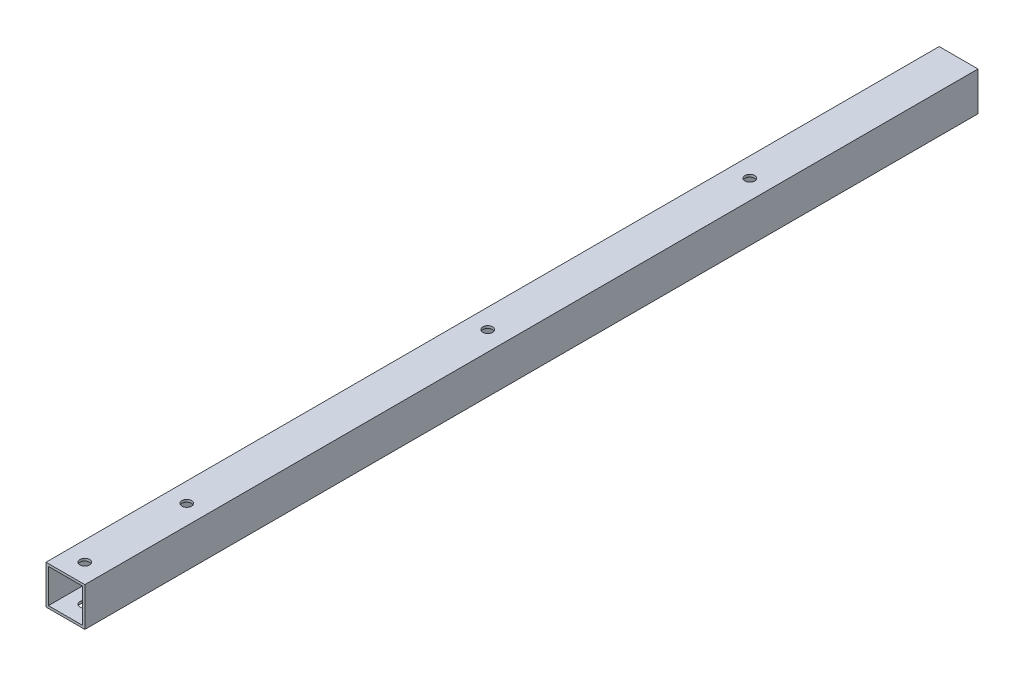
ISO-10303-21;
HEADER;
FILE_DESCRIPTION(('STEP AP214'),'2;1');
FILE_NAME('part.step','',(''),(''),'','','');
FILE_SCHEMA(('AUTOMOTIVE_DESIGN { 1 0 10303 214 1 1 1 1 }'));
ENDSEC;
DATA;
#1=APPLICATION_CONTEXT('core data for automotive mechanical design processes');
#2=APPLICATION_PROTOCOL_DEFINITION('international standard','automotive_design',2000,#1);
#3=PRODUCT_CONTEXT('',#1,'mechanical');
#4=PRODUCT('Part','Part','',(#3));
#5=PRODUCT_RELATED_PRODUCT_CATEGORY('part','',(#4));
#6=PRODUCT_DEFINITION_FORMATION('','',#4);
#7=PRODUCT_DEFINITION_CONTEXT('part definition',#1,'design');
#8=PRODUCT_DEFINITION('design','',#6,#7);
#9=PRODUCT_DEFINITION_SHAPE('','',#8);
#10=(LENGTH_UNIT() NAMED_UNIT(*) SI_UNIT(.MILLI.,.METRE.));
#11=(NAMED_UNIT(*) PLANE_ANGLE_UNIT() SI_UNIT($,.RADIAN.));
#12=(NAMED_UNIT(*) SI_UNIT($,.STERADIAN.) SOLID_ANGLE_UNIT());
#13=UNCERTAINTY_MEASURE_WITH_UNIT(LENGTH_MEASURE(1.E-05),#10,'distance_accuracy_value','');
#14=(GEOMETRIC_REPRESENTATION_CONTEXT(3) GLOBAL_UNCERTAINTY_ASSIGNED_CONTEXT((#13)) GLOBAL_UNIT_ASSIGNED_CONTEXT((#10,
#11,#12)) REPRESENTATION_CONTEXT('',''));
#15=CARTESIAN_POINT('',(0.,0.,0.));
#16=DIRECTION('',(0.,0.,1.));
#17=DIRECTION('',(1.,0.,0.));
#18=AXIS2_PLACEMENT_3D('',#15,#16,#17);
#19=CARTESIAN_POINT('',(-539.75,330.2,-50.8));
#20=DIRECTION('',(-1.,0.,0.));
#21=DIRECTION('',(0.,0.,1.));
#22=AXIS2_PLACEMENT_3D('',#19,#20,#21);
#23=PLANE('',#22);
#24=DIRECTION('',(0.,0.,1.));
#25=VECTOR('',#24,1.);
#26=CARTESIAN_POINT('',(-539.75,279.4,-50.8));
#27=LINE('',#26,#25);
#28=CARTESIAN_POINT('',(-539.75,279.4,-50.8));
#29=VERTEX_POINT('',#28);
#30=CARTESIAN_POINT('',(-539.75,279.4,1117.6));
#31=VERTEX_POINT('',#30);
#32=EDGE_CURVE('E171',#29,#31,#27,.T.);
#33=ORIENTED_EDGE('',*,*,#32,.T.);
#34=DIRECTION('',(0.,-1.,0.));
#35=VECTOR('',#34,1.);
#36=CARTESIAN_POINT('',(-539.75,330.2,1117.6));
#37=LINE('',#36,#35);
#38=CARTESIAN_POINT('',(-539.75,330.2,1117.6));
#39=VERTEX_POINT('',#38);
#40=EDGE_CURVE('E136',#39,#31,#37,.T.);
#41=ORIENTED_EDGE('',*,*,#40,.F.);
#42=DIRECTION('',(0.,0.,1.));
#43=VECTOR('',#42,1.);
#44=CARTESIAN_POINT('',(-539.75,330.2,-50.8));
#45=LINE('',#44,#43);
#46=CARTESIAN_POINT('',(-539.75,330.2,-50.8));
#47=VERTEX_POINT('',#46);
#48=EDGE_CURVE('E11',#47,#39,#45,.T.);
#49=ORIENTED_EDGE('',*,*,#48,.F.);
#50=DIRECTION('',(0.,-1.,0.));
#51=VECTOR('',#50,1.);
#52=CARTESIAN_POINT('',(-539.75,330.2,-50.8));
#53=LINE('',#52,#51);
#54=EDGE_CURVE('E156',#47,#29,#53,.T.);
#55=ORIENTED_EDGE('',*,*,#54,.T.);
#56=EDGE_LOOP('',(#33,#41,#49,#55));
#57=FACE_BOUND('',#56,.T.);
#58=ADVANCED_FACE('F37',(#57),#23,.T.);
#59=CARTESIAN_POINT('',(-539.75,330.2,-50.8));
#60=DIRECTION('',(0.,1.,0.));
#61=DIRECTION('',(0.,0.,1.));
#62=AXIS2_PLACEMENT_3D('',#59,#60,#61);
#63=PLANE('',#62);
#64=CARTESIAN_POINT('',(-514.35,330.2,222.25));
#65=DIRECTION('',(0.,1.,0.));
#66=DIRECTION('',(0.,0.,1.));
#67=AXIS2_PLACEMENT_3D('',#64,#65,#66);
#68=CIRCLE('',#67,6.34999999999994);
#69=CARTESIAN_POINT('',(-514.35,330.2,228.6));
#70=VERTEX_POINT('',#69);
#71=EDGE_CURVE('E364',#70,#70,#68,.T.);
#72=ORIENTED_EDGE('',*,*,#71,.F.);
#73=EDGE_LOOP('',(#72));
#74=FACE_BOUND('',#73,.T.);
#75=CARTESIAN_POINT('',(-514.35,330.2,565.15));
#76=DIRECTION('',(0.,1.,0.));
#77=DIRECTION('',(0.,0.,1.));
#78=AXIS2_PLACEMENT_3D('',#75,#76,#77);
#79=CIRCLE('',#78,6.34999999999994);
#80=CARTESIAN_POINT('',(-514.35,330.2,571.5));
#81=VERTEX_POINT('',#80);
#82=EDGE_CURVE('E201',#81,#81,#79,.T.);
#83=ORIENTED_EDGE('',*,*,#82,.F.);
#84=EDGE_LOOP('',(#83));
#85=FACE_BOUND('',#84,.T.);
#86=CARTESIAN_POINT('',(-514.35,330.2,958.85));
#87=DIRECTION('',(0.,1.,0.));
#88=DIRECTION('',(0.,0.,1.));
#89=AXIS2_PLACEMENT_3D('',#86,#87,#88);
#90=CIRCLE('',#89,6.34999999999994);
#91=CARTESIAN_POINT('',(-514.35,330.2,965.2));
#92=VERTEX_POINT('',#91);
#93=EDGE_CURVE('E198',#92,#92,#90,.T.);
#94=ORIENTED_EDGE('',*,*,#93,.F.);
#95=EDGE_LOOP('',(#94));
#96=FACE_BOUND('',#95,.T.);
#97=CARTESIAN_POINT('',(-514.35,330.2,1092.2));
#98=DIRECTION('',(0.,1.,0.));
#99=DIRECTION('',(0.,0.,1.));
#100=AXIS2_PLACEMENT_3D('',#97,#98,#99);
#101=CIRCLE('',#100,6.34999999999994);
#102=CARTESIAN_POINT('',(-514.35,330.2,1098.55));
#103=VERTEX_POINT('',#102);
#104=EDGE_CURVE('E218',#103,#103,#101,.T.);
#105=ORIENTED_EDGE('',*,*,#104,.F.);
#106=EDGE_LOOP('',(#105));
#107=FACE_BOUND('',#106,.T.);
#108=ORIENTED_EDGE('',*,*,#48,.T.);
#109=DIRECTION('',(-1.,0.,0.));
#110=VECTOR('',#109,1.);
#111=CARTESIAN_POINT('',(-539.75,330.2,1117.6));
#112=LINE('',#111,#110);
#113=CARTESIAN_POINT('',(-488.95,330.2,1117.6));
#114=VERTEX_POINT('',#113);
#115=EDGE_CURVE('E145',#114,#39,#112,.T.);
#116=ORIENTED_EDGE('',*,*,#115,.F.);
#117=DIRECTION('',(0.,0.,1.));
#118=VECTOR('',#117,1.);
#119=CARTESIAN_POINT('',(-488.95,330.2,-50.8));
#120=LINE('',#119,#118);
#121=CARTESIAN_POINT('',(-488.95,330.2,-50.8));
#122=VERTEX_POINT('',#121);
#123=EDGE_CURVE('E46',#122,#114,#120,.T.);
#124=ORIENTED_EDGE('',*,*,#123,.F.);
#125=DIRECTION('',(-1.,0.,0.));
#126=VECTOR('',#125,1.);
#127=CARTESIAN_POINT('',(-539.75,330.2,-50.8));
#128=LINE('',#127,#126);
#129=EDGE_CURVE('E169',#122,#47,#128,.T.);
#130=ORIENTED_EDGE('',*,*,#129,.T.);
#131=EDGE_LOOP('',(#108,#116,#124,#130));
#132=FACE_BOUND('',#131,.T.);
#133=ADVANCED_FACE('F244',(#74,#85,#96,#107,#132),#63,.T.);
#134=CARTESIAN_POINT('',(-488.95,330.2,-50.8));
#135=DIRECTION('',(1.,0.,0.));
#136=DIRECTION('',(0.,0.,-1.));
#137=AXIS2_PLACEMENT_3D('',#134,#135,#136);
#138=PLANE('',#137);
#139=ORIENTED_EDGE('',*,*,#123,.T.);
#140=DIRECTION('',(0.,1.,0.));
#141=VECTOR('',#140,1.);
#142=CARTESIAN_POINT('',(-488.95,330.2,1117.6));
#143=LINE('',#142,#141);
#144=CARTESIAN_POINT('',(-488.95,279.4,1117.6));
#145=VERTEX_POINT('',#144);
#146=EDGE_CURVE('E142',#145,#114,#143,.T.);
#147=ORIENTED_EDGE('',*,*,#146,.F.);
#148=DIRECTION('',(0.,0.,1.));
#149=VECTOR('',#148,1.);
#150=CARTESIAN_POINT('',(-488.95,279.4,-50.8));
#151=LINE('',#150,#149);
#152=CARTESIAN_POINT('',(-488.95,279.4,-50.8));
#153=VERTEX_POINT('',#152);
#154=EDGE_CURVE('E175',#153,#145,#151,.T.);
#155=ORIENTED_EDGE('',*,*,#154,.F.);
#156=DIRECTION('',(0.,1.,0.));
#157=VECTOR('',#156,1.);
#158=CARTESIAN_POINT('',(-488.95,330.2,-50.8));
#159=LINE('',#158,#157);
#160=EDGE_CURVE('E166',#153,#122,#159,.T.);
#161=ORIENTED_EDGE('',*,*,#160,.T.);
#162=EDGE_LOOP('',(#139,#147,#155,#161));
#163=FACE_BOUND('',#162,.T.);
#164=ADVANCED_FACE('F248',(#163),#138,.T.);
#165=CARTESIAN_POINT('',(-539.75,279.4,-50.8));
#166=DIRECTION('',(0.,-1.,0.));
#167=DIRECTION('',(0.,0.,-1.));
#168=AXIS2_PLACEMENT_3D('',#165,#166,#167);
#169=PLANE('',#168);
#170=CARTESIAN_POINT('',(-514.35,279.4,222.25));
#171=DIRECTION('',(0.,1.,0.));
#172=DIRECTION('',(0.,0.,1.));
#173=AXIS2_PLACEMENT_3D('',#170,#171,#172);
#174=CIRCLE('',#173,6.34999999999994);
#175=CARTESIAN_POINT('',(-514.35,279.4,228.6));
#176=VERTEX_POINT('',#175);
#177=EDGE_CURVE('E368',#176,#176,#174,.T.);
#178=ORIENTED_EDGE('',*,*,#177,.T.);
#179=EDGE_LOOP('',(#178));
#180=FACE_BOUND('',#179,.T.);
#181=CARTESIAN_POINT('',(-514.35,279.4,565.15));
#182=DIRECTION('',(0.,1.,0.));
#183=DIRECTION('',(0.,0.,1.));
#184=AXIS2_PLACEMENT_3D('',#181,#182,#183);
#185=CIRCLE('',#184,6.34999999999994);
#186=CARTESIAN_POINT('',(-514.35,279.4,571.5));
#187=VERTEX_POINT('',#186);
#188=EDGE_CURVE('E192',#187,#187,#185,.T.);
#189=ORIENTED_EDGE('',*,*,#188,.T.);
#190=EDGE_LOOP('',(#189));
#191=FACE_BOUND('',#190,.T.);
#192=CARTESIAN_POINT('',(-514.35,279.4,958.85));
#193=DIRECTION('',(0.,1.,0.));
#194=DIRECTION('',(0.,0.,1.));
#195=AXIS2_PLACEMENT_3D('',#192,#193,#194);
#196=CIRCLE('',#195,6.34999999999994);
#197=CARTESIAN_POINT('',(-514.35,279.4,965.2));
#198=VERTEX_POINT('',#197);
#199=EDGE_CURVE('E187',#198,#198,#196,.T.);
#200=ORIENTED_EDGE('',*,*,#199,.T.);
#201=EDGE_LOOP('',(#200));
#202=FACE_BOUND('',#201,.T.);
#203=CARTESIAN_POINT('',(-514.35,279.4,1092.2));
#204=DIRECTION('',(0.,1.,0.));
#205=DIRECTION('',(0.,0.,1.));
#206=AXIS2_PLACEMENT_3D('',#203,#204,#205);
#207=CIRCLE('',#206,6.34999999999994);
#208=CARTESIAN_POINT('',(-514.35,279.4,1098.55));
#209=VERTEX_POINT('',#208);
#210=EDGE_CURVE('E183',#209,#209,#207,.T.);
#211=ORIENTED_EDGE('',*,*,#210,.T.);
#212=EDGE_LOOP('',(#211));
#213=FACE_BOUND('',#212,.T.);
#214=ORIENTED_EDGE('',*,*,#154,.T.);
#215=DIRECTION('',(1.,0.,0.));
#216=VECTOR('',#215,1.);
#217=CARTESIAN_POINT('',(-539.75,279.4,1117.6));
#218=LINE('',#217,#216);
#219=EDGE_CURVE('E139',#31,#145,#218,.T.);
#220=ORIENTED_EDGE('',*,*,#219,.F.);
#221=ORIENTED_EDGE('',*,*,#32,.F.);
#222=DIRECTION('',(1.,0.,0.));
#223=VECTOR('',#222,1.);
#224=CARTESIAN_POINT('',(-539.75,279.4,-50.8));
#225=LINE('',#224,#223);
#226=EDGE_CURVE('E163',#29,#153,#225,.T.);
#227=ORIENTED_EDGE('',*,*,#226,.T.);
#228=EDGE_LOOP('',(#214,#220,#221,#227));
#229=FACE_BOUND('',#228,.T.);
#230=ADVANCED_FACE('F254',(#180,#191,#202,#213,#229),#169,.T.);
#231=CARTESIAN_POINT('',(-539.75,279.4,-50.8));
#232=DIRECTION('',(0.,0.,1.));
#233=DIRECTION('',(1.,0.,0.));
#234=AXIS2_PLACEMENT_3D('',#231,#232,#233);
#235=PLANE('',#234);
#236=DIRECTION('',(-1.,0.,0.));
#237=VECTOR('',#236,1.);
#238=CARTESIAN_POINT('',(-536.575,327.025,-50.8));
#239=LINE('',#238,#237);
#240=CARTESIAN_POINT('',(-492.125,327.025,-50.8));
#241=VERTEX_POINT('',#240);
#242=CARTESIAN_POINT('',(-536.575,327.025,-50.8));
#243=VERTEX_POINT('',#242);
#244=EDGE_CURVE('E116',#241,#243,#239,.T.);
#245=ORIENTED_EDGE('',*,*,#244,.T.);
#246=DIRECTION('',(0.,-1.,0.));
#247=VECTOR('',#246,1.);
#248=CARTESIAN_POINT('',(-536.575,327.025,-50.8));
#249=LINE('',#248,#247);
#250=CARTESIAN_POINT('',(-536.575,282.575,-50.8));
#251=VERTEX_POINT('',#250);
#252=EDGE_CURVE('E148',#243,#251,#249,.T.);
#253=ORIENTED_EDGE('',*,*,#252,.T.);
#254=DIRECTION('',(1.,0.,0.));
#255=VECTOR('',#254,1.);
#256=CARTESIAN_POINT('',(-536.575,282.575,-50.8));
#257=LINE('',#256,#255);
#258=CARTESIAN_POINT('',(-492.125,282.575,-50.8));
#259=VERTEX_POINT('',#258);
#260=EDGE_CURVE('E110',#251,#259,#257,.T.);
#261=ORIENTED_EDGE('',*,*,#260,.T.);
#262=DIRECTION('',(0.,1.,0.));
#263=VECTOR('',#262,1.);
#264=CARTESIAN_POINT('',(-492.125,327.025,-50.8));
#265=LINE('',#264,#263);
#266=EDGE_CURVE('E54',#259,#241,#265,.T.);
#267=ORIENTED_EDGE('',*,*,#266,.T.);
#268=EDGE_LOOP('',(#245,#253,#261,#267));
#269=FACE_BOUND('',#268,.T.);
#270=ORIENTED_EDGE('',*,*,#54,.F.);
#271=ORIENTED_EDGE('',*,*,#129,.F.);
#272=ORIENTED_EDGE('',*,*,#160,.F.);
#273=ORIENTED_EDGE('',*,*,#226,.F.);
#274=EDGE_LOOP('',(#270,#271,#272,#273));
#275=FACE_BOUND('',#274,.T.);
#276=ADVANCED_FACE('F262',(#269,#275),#235,.F.);
#277=CARTESIAN_POINT('',(-536.575,327.025,-50.8));
#278=DIRECTION('',(-1.,0.,0.));
#279=DIRECTION('',(0.,0.,1.));
#280=AXIS2_PLACEMENT_3D('',#277,#278,#279);
#281=PLANE('',#280);
#282=DIRECTION('',(0.,0.,1.));
#283=VECTOR('',#282,1.);
#284=CARTESIAN_POINT('',(-536.575,327.025,-50.8));
#285=LINE('',#284,#283);
#286=CARTESIAN_POINT('',(-536.575,327.025,1117.6));
#287=VERTEX_POINT('',#286);
#288=EDGE_CURVE('E121',#243,#287,#285,.T.);
#289=ORIENTED_EDGE('',*,*,#288,.T.);
#290=DIRECTION('',(0.,-1.,0.));
#291=VECTOR('',#290,1.);
#292=CARTESIAN_POINT('',(-536.575,327.025,1117.6));
#293=LINE('',#292,#291);
#294=CARTESIAN_POINT('',(-536.575,282.575,1117.6));
#295=VERTEX_POINT('',#294);
#296=EDGE_CURVE('E119',#287,#295,#293,.T.);
#297=ORIENTED_EDGE('',*,*,#296,.T.);
#298=DIRECTION('',(0.,0.,1.));
#299=VECTOR('',#298,1.);
#300=CARTESIAN_POINT('',(-536.575,282.575,-50.8));
#301=LINE('',#300,#299);
#302=EDGE_CURVE('E103',#251,#295,#301,.T.);
#303=ORIENTED_EDGE('',*,*,#302,.F.);
#304=ORIENTED_EDGE('',*,*,#252,.F.);
#305=EDGE_LOOP('',(#289,#297,#303,#304));
#306=FACE_BOUND('',#305,.T.);
#307=ADVANCED_FACE('F120',(#306),#281,.F.);
#308=CARTESIAN_POINT('',(-536.575,327.025,-50.8));
#309=DIRECTION('',(0.,1.,0.));
#310=DIRECTION('',(0.,0.,1.));
#311=AXIS2_PLACEMENT_3D('',#308,#309,#310);
#312=PLANE('',#311);
#313=CARTESIAN_POINT('',(-514.35,327.025,222.25));
#314=DIRECTION('',(0.,1.,0.));
#315=DIRECTION('',(0.,0.,1.));
#316=AXIS2_PLACEMENT_3D('',#313,#314,#315);
#317=CIRCLE('',#316,6.34999999999994);
#318=CARTESIAN_POINT('',(-514.35,327.025,228.6));
#319=VERTEX_POINT('',#318);
#320=EDGE_CURVE('E207',#319,#319,#317,.T.);
#321=ORIENTED_EDGE('',*,*,#320,.T.);
#322=EDGE_LOOP('',(#321));
#323=FACE_BOUND('',#322,.T.);
#324=CARTESIAN_POINT('',(-514.35,327.025,565.15));
#325=DIRECTION('',(0.,1.,0.));
#326=DIRECTION('',(0.,0.,1.));
#327=AXIS2_PLACEMENT_3D('',#324,#325,#326);
#328=CIRCLE('',#327,6.34999999999994);
#329=CARTESIAN_POINT('',(-514.35,327.025,571.5));
#330=VERTEX_POINT('',#329);
#331=EDGE_CURVE('E191',#330,#330,#328,.T.);
#332=ORIENTED_EDGE('',*,*,#331,.T.);
#333=EDGE_LOOP('',(#332));
#334=FACE_BOUND('',#333,.T.);
#335=CARTESIAN_POINT('',(-514.35,327.025,958.85));
#336=DIRECTION('',(0.,1.,0.));
#337=DIRECTION('',(0.,0.,1.));
#338=AXIS2_PLACEMENT_3D('',#335,#336,#337);
#339=CIRCLE('',#338,6.34999999999994);
#340=CARTESIAN_POINT('',(-514.35,327.025,965.2));
#341=VERTEX_POINT('',#340);
#342=EDGE_CURVE('E186',#341,#341,#339,.T.);
#343=ORIENTED_EDGE('',*,*,#342,.T.);
#344=EDGE_LOOP('',(#343));
#345=FACE_BOUND('',#344,.T.);
#346=CARTESIAN_POINT('',(-514.35,327.025,1092.2));
#347=DIRECTION('',(0.,1.,0.));
#348=DIRECTION('',(0.,0.,1.));
#349=AXIS2_PLACEMENT_3D('',#346,#347,#348);
#350=CIRCLE('',#349,6.34999999999994);
#351=CARTESIAN_POINT('',(-514.35,327.025,1098.55));
#352=VERTEX_POINT('',#351);
#353=EDGE_CURVE('E125',#352,#352,#350,.T.);
#354=ORIENTED_EDGE('',*,*,#353,.T.);
#355=EDGE_LOOP('',(#354));
#356=FACE_BOUND('',#355,.T.);
#357=DIRECTION('',(0.,0.,1.));
#358=VECTOR('',#357,1.);
#359=CARTESIAN_POINT('',(-492.125,327.025,-50.8));
#360=LINE('',#359,#358);
#361=CARTESIAN_POINT('',(-492.125,327.025,1117.6));
#362=VERTEX_POINT('',#361);
#363=EDGE_CURVE('E157',#241,#362,#360,.T.);
#364=ORIENTED_EDGE('',*,*,#363,.T.);
#365=DIRECTION('',(-1.,0.,0.));
#366=VECTOR('',#365,1.);
#367=CARTESIAN_POINT('',(-536.575,327.025,1117.6));
#368=LINE('',#367,#366);
#369=EDGE_CURVE('E131',#362,#287,#368,.T.);
#370=ORIENTED_EDGE('',*,*,#369,.T.);
#371=ORIENTED_EDGE('',*,*,#288,.F.);
#372=ORIENTED_EDGE('',*,*,#244,.F.);
#373=EDGE_LOOP('',(#364,#370,#371,#372));
#374=FACE_BOUND('',#373,.T.);
#375=ADVANCED_FACE('F225',(#323,#334,#345,#356,#374),#312,.F.);
#376=CARTESIAN_POINT('',(-492.125,327.025,-50.8));
#377=DIRECTION('',(1.,0.,0.));
#378=DIRECTION('',(0.,0.,-1.));
#379=AXIS2_PLACEMENT_3D('',#376,#377,#378);
#380=PLANE('',#379);
#381=DIRECTION('',(0.,0.,1.));
#382=VECTOR('',#381,1.);
#383=CARTESIAN_POINT('',(-492.125,282.575,-50.8));
#384=LINE('',#383,#382);
#385=CARTESIAN_POINT('',(-492.125,282.575,1117.6));
#386=VERTEX_POINT('',#385);
#387=EDGE_CURVE('E115',#259,#386,#384,.T.);
#388=ORIENTED_EDGE('',*,*,#387,.T.);
#389=DIRECTION('',(0.,1.,0.));
#390=VECTOR('',#389,1.);
#391=CARTESIAN_POINT('',(-492.125,327.025,1117.6));
#392=LINE('',#391,#390);
#393=EDGE_CURVE('E129',#386,#362,#392,.T.);
#394=ORIENTED_EDGE('',*,*,#393,.T.);
#395=ORIENTED_EDGE('',*,*,#363,.F.);
#396=ORIENTED_EDGE('',*,*,#266,.F.);
#397=EDGE_LOOP('',(#388,#394,#395,#396));
#398=FACE_BOUND('',#397,.T.);
#399=ADVANCED_FACE('F278',(#398),#380,.F.);
#400=CARTESIAN_POINT('',(-536.575,282.575,-50.8));
#401=DIRECTION('',(0.,-1.,0.));
#402=DIRECTION('',(0.,0.,-1.));
#403=AXIS2_PLACEMENT_3D('',#400,#401,#402);
#404=PLANE('',#403);
#405=CARTESIAN_POINT('',(-514.35,282.575,222.25));
#406=DIRECTION('',(0.,-1.,0.));
#407=DIRECTION('',(0.,0.,-1.));
#408=AXIS2_PLACEMENT_3D('',#405,#406,#407);
#409=CIRCLE('',#408,6.34999999999994);
#410=CARTESIAN_POINT('',(-514.35,282.575,215.9));
#411=VERTEX_POINT('',#410);
#412=EDGE_CURVE('E40',#411,#411,#409,.T.);
#413=ORIENTED_EDGE('',*,*,#412,.T.);
#414=EDGE_LOOP('',(#413));
#415=FACE_BOUND('',#414,.T.);
#416=CARTESIAN_POINT('',(-514.35,282.575,565.15));
#417=DIRECTION('',(0.,-1.,0.));
#418=DIRECTION('',(0.,0.,-1.));
#419=AXIS2_PLACEMENT_3D('',#416,#417,#418);
#420=CIRCLE('',#419,6.34999999999994);
#421=CARTESIAN_POINT('',(-514.35,282.575,558.8));
#422=VERTEX_POINT('',#421);
#423=EDGE_CURVE('E188',#422,#422,#420,.T.);
#424=ORIENTED_EDGE('',*,*,#423,.T.);
#425=EDGE_LOOP('',(#424));
#426=FACE_BOUND('',#425,.T.);
#427=CARTESIAN_POINT('',(-514.35,282.575,958.85));
#428=DIRECTION('',(0.,-1.,0.));
#429=DIRECTION('',(0.,0.,-1.));
#430=AXIS2_PLACEMENT_3D('',#427,#428,#429);
#431=CIRCLE('',#430,6.34999999999994);
#432=CARTESIAN_POINT('',(-514.35,282.575,952.5));
#433=VERTEX_POINT('',#432);
#434=EDGE_CURVE('E184',#433,#433,#431,.T.);
#435=ORIENTED_EDGE('',*,*,#434,.T.);
#436=EDGE_LOOP('',(#435));
#437=FACE_BOUND('',#436,.T.);
#438=CARTESIAN_POINT('',(-514.35,282.575,1092.2));
#439=DIRECTION('',(0.,-1.,0.));
#440=DIRECTION('',(0.,0.,-1.));
#441=AXIS2_PLACEMENT_3D('',#438,#439,#440);
#442=CIRCLE('',#441,6.34999999999994);
#443=CARTESIAN_POINT('',(-514.35,282.575,1085.85));
#444=VERTEX_POINT('',#443);
#445=EDGE_CURVE('E180',#444,#444,#442,.T.);
#446=ORIENTED_EDGE('',*,*,#445,.T.);
#447=EDGE_LOOP('',(#446));
#448=FACE_BOUND('',#447,.T.);
#449=ORIENTED_EDGE('',*,*,#302,.T.);
#450=DIRECTION('',(1.,0.,0.));
#451=VECTOR('',#450,1.);
#452=CARTESIAN_POINT('',(-536.575,282.575,1117.6));
#453=LINE('',#452,#451);
#454=EDGE_CURVE('E107',#295,#386,#453,.T.);
#455=ORIENTED_EDGE('',*,*,#454,.T.);
#456=ORIENTED_EDGE('',*,*,#387,.F.);
#457=ORIENTED_EDGE('',*,*,#260,.F.);
#458=EDGE_LOOP('',(#449,#455,#456,#457));
#459=FACE_BOUND('',#458,.T.);
#460=ADVANCED_FACE('F105',(#415,#426,#437,#448,#459),#404,.F.);
#461=CARTESIAN_POINT('',(-539.75,279.4,1117.6));
#462=DIRECTION('',(0.,0.,1.));
#463=DIRECTION('',(1.,0.,0.));
#464=AXIS2_PLACEMENT_3D('',#461,#462,#463);
#465=PLANE('',#464);
#466=ORIENTED_EDGE('',*,*,#40,.T.);
#467=ORIENTED_EDGE('',*,*,#219,.T.);
#468=ORIENTED_EDGE('',*,*,#146,.T.);
#469=ORIENTED_EDGE('',*,*,#115,.T.);
#470=EDGE_LOOP('',(#466,#467,#468,#469));
#471=FACE_BOUND('',#470,.T.);
#472=ORIENTED_EDGE('',*,*,#454,.F.);
#473=ORIENTED_EDGE('',*,*,#296,.F.);
#474=ORIENTED_EDGE('',*,*,#369,.F.);
#475=ORIENTED_EDGE('',*,*,#393,.F.);
#476=EDGE_LOOP('',(#472,#473,#474,#475));
#477=FACE_BOUND('',#476,.T.);
#478=ADVANCED_FACE('F127',(#471,#477),#465,.T.);
#479=CARTESIAN_POINT('',(-514.35,279.4,1092.2));
#480=DIRECTION('',(0.,1.,0.));
#481=DIRECTION('',(0.,0.,1.));
#482=AXIS2_PLACEMENT_3D('',#479,#480,#481);
#483=CYLINDRICAL_SURFACE('',#482,6.34999999999994);
#484=ORIENTED_EDGE('',*,*,#210,.F.);
#485=EDGE_LOOP('',(#484));
#486=FACE_BOUND('',#485,.T.);
#487=ORIENTED_EDGE('',*,*,#445,.F.);
#488=EDGE_LOOP('',(#487));
#489=FACE_BOUND('',#488,.T.);
#490=ADVANCED_FACE('F231',(#486,#489),#483,.F.);
#491=ORIENTED_EDGE('',*,*,#104,.T.);
#492=EDGE_LOOP('',(#491));
#493=FACE_BOUND('',#492,.T.);
#494=ORIENTED_EDGE('',*,*,#353,.F.);
#495=EDGE_LOOP('',(#494));
#496=FACE_BOUND('',#495,.T.);
#497=ADVANCED_FACE('F228',(#493,#496),#483,.F.);
#498=CARTESIAN_POINT('',(-514.35,279.4,958.85));
#499=DIRECTION('',(0.,1.,0.));
#500=DIRECTION('',(0.,0.,1.));
#501=AXIS2_PLACEMENT_3D('',#498,#499,#500);
#502=CYLINDRICAL_SURFACE('',#501,6.34999999999994);
#503=ORIENTED_EDGE('',*,*,#199,.F.);
#504=EDGE_LOOP('',(#503));
#505=FACE_BOUND('',#504,.T.);
#506=ORIENTED_EDGE('',*,*,#434,.F.);
#507=EDGE_LOOP('',(#506));
#508=FACE_BOUND('',#507,.T.);
#509=ADVANCED_FACE('F230',(#505,#508),#502,.F.);
#510=ORIENTED_EDGE('',*,*,#93,.T.);
#511=EDGE_LOOP('',(#510));
#512=FACE_BOUND('',#511,.T.);
#513=ORIENTED_EDGE('',*,*,#342,.F.);
#514=EDGE_LOOP('',(#513));
#515=FACE_BOUND('',#514,.T.);
#516=ADVANCED_FACE('F238',(#512,#515),#502,.F.);
#517=CARTESIAN_POINT('',(-514.35,279.4,565.15));
#518=DIRECTION('',(0.,1.,0.));
#519=DIRECTION('',(0.,0.,1.));
#520=AXIS2_PLACEMENT_3D('',#517,#518,#519);
#521=CYLINDRICAL_SURFACE('',#520,6.34999999999994);
#522=ORIENTED_EDGE('',*,*,#188,.F.);
#523=EDGE_LOOP('',(#522));
#524=FACE_BOUND('',#523,.T.);
#525=ORIENTED_EDGE('',*,*,#423,.F.);
#526=EDGE_LOOP('',(#525));
#527=FACE_BOUND('',#526,.T.);
#528=ADVANCED_FACE('F318',(#524,#527),#521,.F.);
#529=ORIENTED_EDGE('',*,*,#82,.T.);
#530=EDGE_LOOP('',(#529));
#531=FACE_BOUND('',#530,.T.);
#532=ORIENTED_EDGE('',*,*,#331,.F.);
#533=EDGE_LOOP('',(#532));
#534=FACE_BOUND('',#533,.T.);
#535=ADVANCED_FACE('F327',(#531,#534),#521,.F.);
#536=CARTESIAN_POINT('',(-514.35,279.4,222.25));
#537=DIRECTION('',(0.,1.,0.));
#538=DIRECTION('',(0.,0.,1.));
#539=AXIS2_PLACEMENT_3D('',#536,#537,#538);
#540=CYLINDRICAL_SURFACE('',#539,6.34999999999994);
#541=ORIENTED_EDGE('',*,*,#177,.F.);
#542=EDGE_LOOP('',(#541));
#543=FACE_BOUND('',#542,.T.);
#544=ORIENTED_EDGE('',*,*,#412,.F.);
#545=EDGE_LOOP('',(#544));
#546=FACE_BOUND('',#545,.T.);
#547=ADVANCED_FACE('F338',(#543,#546),#540,.F.);
#548=ORIENTED_EDGE('',*,*,#71,.T.);
#549=EDGE_LOOP('',(#548));
#550=FACE_BOUND('',#549,.T.);
#551=ORIENTED_EDGE('',*,*,#320,.F.);
#552=EDGE_LOOP('',(#551));
#553=FACE_BOUND('',#552,.T.);
#554=ADVANCED_FACE('F348',(#550,#553),#540,.F.);
#555=CLOSED_SHELL('',(#58,#133,#164,#230,#276,#307,#375,#399,#460,#478,#490,#497,#509,#516,#528,
#535,#547,#554));
#556=MANIFOLD_SOLID_BREP('B2',#555);
#557=ADVANCED_BREP_SHAPE_REPRESENTATION('',(#18,#556),#14);
#558=SHAPE_DEFINITION_REPRESENTATION(#9,#557);
ENDSEC;
END-ISO-10303-21;
